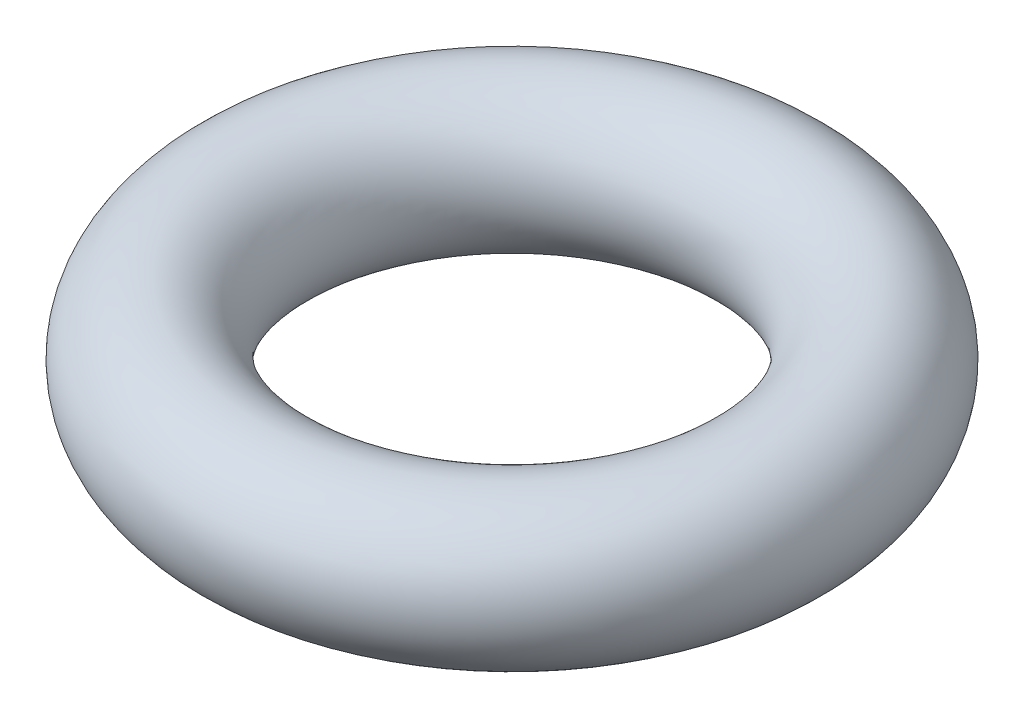
ISO-10303-21;
HEADER;
FILE_DESCRIPTION(('STEP AP214'),'2;1');
FILE_NAME('part.step','',(''),(''),'','','');
FILE_SCHEMA(('AUTOMOTIVE_DESIGN { 1 0 10303 214 1 1 1 1 }'));
ENDSEC;
DATA;
#1=APPLICATION_CONTEXT('core data for automotive mechanical design processes');
#2=APPLICATION_PROTOCOL_DEFINITION('international standard','automotive_design',2000,#1);
#3=PRODUCT_CONTEXT('',#1,'mechanical');
#4=PRODUCT('Part','Part','',(#3));
#5=PRODUCT_RELATED_PRODUCT_CATEGORY('part','',(#4));
#6=PRODUCT_DEFINITION_FORMATION('','',#4);
#7=PRODUCT_DEFINITION_CONTEXT('part definition',#1,'design');
#8=PRODUCT_DEFINITION('design','',#6,#7);
#9=PRODUCT_DEFINITION_SHAPE('','',#8);
#10=(LENGTH_UNIT() NAMED_UNIT(*) SI_UNIT(.MILLI.,.METRE.));
#11=(NAMED_UNIT(*) PLANE_ANGLE_UNIT() SI_UNIT($,.RADIAN.));
#12=(NAMED_UNIT(*) SI_UNIT($,.STERADIAN.) SOLID_ANGLE_UNIT());
#13=UNCERTAINTY_MEASURE_WITH_UNIT(LENGTH_MEASURE(1.E-05),#10,'distance_accuracy_value','');
#14=(GEOMETRIC_REPRESENTATION_CONTEXT(3) GLOBAL_UNCERTAINTY_ASSIGNED_CONTEXT((#13)) GLOBAL_UNIT_ASSIGNED_CONTEXT((#10,
#11,#12)) REPRESENTATION_CONTEXT('',''));
#15=CARTESIAN_POINT('',(0.,0.,0.));
#16=DIRECTION('',(0.,0.,1.));
#17=DIRECTION('',(1.,0.,0.));
#18=AXIS2_PLACEMENT_3D('',#15,#16,#17);
#19=CARTESIAN_POINT('',(0.,0.,0.));
#20=DIRECTION('',(0.,-1.,0.));
#21=DIRECTION('',(0.,0.,-1.));
#22=AXIS2_PLACEMENT_3D('',#19,#20,#21);
#23=TOROIDAL_SURFACE('',#22,3.5,0.999999999999999);
#24=CARTESIAN_POINT('',(0.,0.,-4.50000000000001));
#25=VERTEX_POINT('',#24);
#26=VERTEX_LOOP('',#25);
#27=FACE_BOUND('',#26,.T.);
#28=ADVANCED_FACE('F28',(#27),#23,.T.);
#29=CLOSED_SHELL('',(#28));
#30=MANIFOLD_SOLID_BREP('B2',#29);
#31=ADVANCED_BREP_SHAPE_REPRESENTATION('',(#18,#30),#14);
#32=SHAPE_DEFINITION_REPRESENTATION(#9,#31);
ENDSEC;
END-ISO-10303-21;
